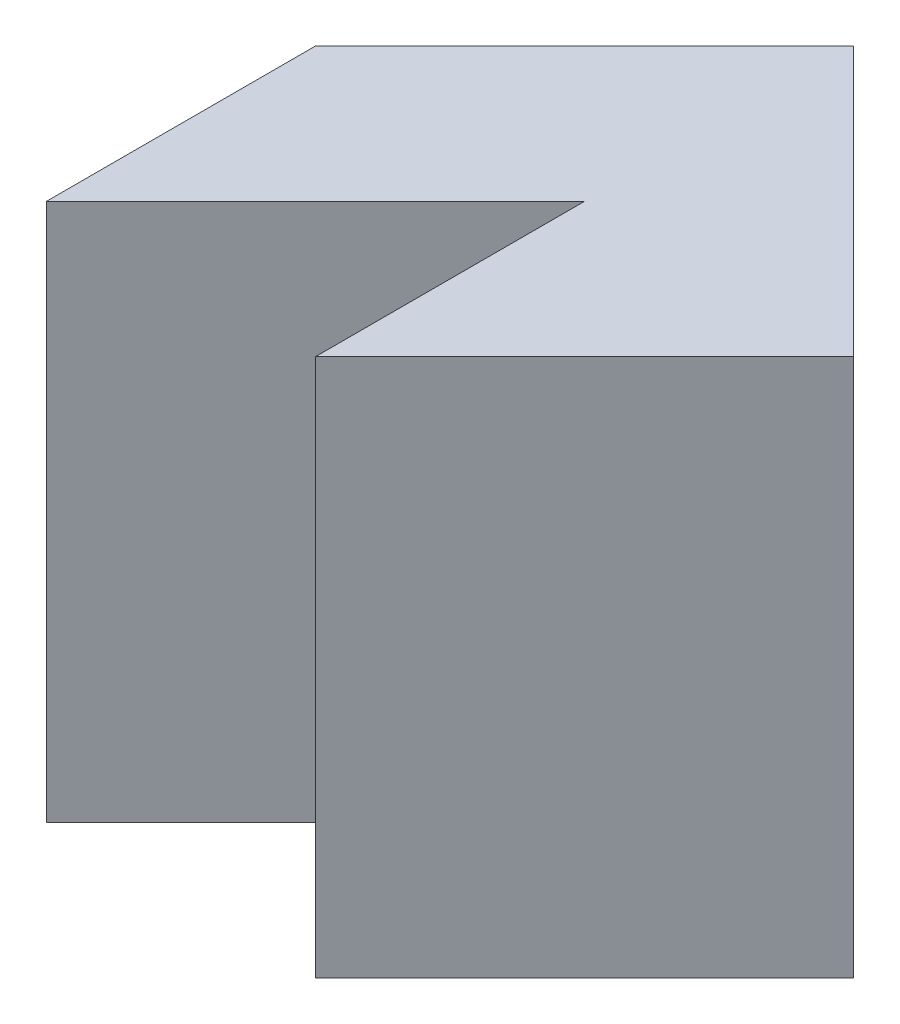
ISO-10303-21;
HEADER;
FILE_DESCRIPTION(('STEP AP214'),'2;1');
FILE_NAME('part.step','',(''),(''),'','','');
FILE_SCHEMA(('AUTOMOTIVE_DESIGN { 1 0 10303 214 1 1 1 1 }'));
ENDSEC;
DATA;
#1=APPLICATION_CONTEXT('core data for automotive mechanical design processes');
#2=APPLICATION_PROTOCOL_DEFINITION('international standard','automotive_design',2000,#1);
#3=PRODUCT_CONTEXT('',#1,'mechanical');
#4=PRODUCT('Part','Part','',(#3));
#5=PRODUCT_RELATED_PRODUCT_CATEGORY('part','',(#4));
#6=PRODUCT_DEFINITION_FORMATION('','',#4);
#7=PRODUCT_DEFINITION_CONTEXT('part definition',#1,'design');
#8=PRODUCT_DEFINITION('design','',#6,#7);
#9=PRODUCT_DEFINITION_SHAPE('','',#8);
#10=(LENGTH_UNIT() NAMED_UNIT(*) SI_UNIT(.MILLI.,.METRE.));
#11=(NAMED_UNIT(*) PLANE_ANGLE_UNIT() SI_UNIT($,.RADIAN.));
#12=(NAMED_UNIT(*) SI_UNIT($,.STERADIAN.) SOLID_ANGLE_UNIT());
#13=UNCERTAINTY_MEASURE_WITH_UNIT(LENGTH_MEASURE(1.E-05),#10,'distance_accuracy_value','');
#14=(GEOMETRIC_REPRESENTATION_CONTEXT(3) GLOBAL_UNCERTAINTY_ASSIGNED_CONTEXT((#13)) GLOBAL_UNIT_ASSIGNED_CONTEXT((#10,
#11,#12)) REPRESENTATION_CONTEXT('',''));
#15=CARTESIAN_POINT('',(0.,0.,0.));
#16=DIRECTION('',(0.,0.,1.));
#17=DIRECTION('',(1.,0.,0.));
#18=AXIS2_PLACEMENT_3D('',#15,#16,#17);
#19=CARTESIAN_POINT('',(2.,4.,-2.));
#20=DIRECTION('',(-0.707106781186547,0.,-0.707106781186548));
#21=DIRECTION('',(-0.707106781186548,0.,0.707106781186547));
#22=AXIS2_PLACEMENT_3D('',#19,#20,#21);
#23=PLANE('',#22);
#24=DIRECTION('',(0.707106781186548,0.,-0.707106781186547));
#25=VECTOR('',#24,1.);
#26=CARTESIAN_POINT('',(2.,0.,-2.));
#27=LINE('',#26,#25);
#28=CARTESIAN_POINT('',(0.,0.,0.));
#29=VERTEX_POINT('',#28);
#30=CARTESIAN_POINT('',(2.,0.,-2.));
#31=VERTEX_POINT('',#30);
#32=EDGE_CURVE('E117',#29,#31,#27,.T.);
#33=ORIENTED_EDGE('',*,*,#32,.T.);
#34=DIRECTION('',(0.,-1.,0.));
#35=VECTOR('',#34,1.);
#36=CARTESIAN_POINT('',(2.,4.,-2.));
#37=LINE('',#36,#35);
#38=CARTESIAN_POINT('',(2.,4.,-2.));
#39=VERTEX_POINT('',#38);
#40=EDGE_CURVE('E11',#39,#31,#37,.T.);
#41=ORIENTED_EDGE('',*,*,#40,.F.);
#42=DIRECTION('',(0.707106781186548,0.,-0.707106781186547));
#43=VECTOR('',#42,1.);
#44=CARTESIAN_POINT('',(2.,4.,-2.));
#45=LINE('',#44,#43);
#46=CARTESIAN_POINT('',(0.,4.,0.));
#47=VERTEX_POINT('',#46);
#48=EDGE_CURVE('E127',#47,#39,#45,.T.);
#49=ORIENTED_EDGE('',*,*,#48,.F.);
#50=DIRECTION('',(0.,-1.,0.));
#51=VECTOR('',#50,1.);
#52=CARTESIAN_POINT('',(0.,4.,0.));
#53=LINE('',#52,#51);
#54=EDGE_CURVE('E113',#47,#29,#53,.T.);
#55=ORIENTED_EDGE('',*,*,#54,.T.);
#56=EDGE_LOOP('',(#33,#41,#49,#55));
#57=FACE_BOUND('',#56,.T.);
#58=ADVANCED_FACE('F33',(#57),#23,.F.);
#59=CARTESIAN_POINT('',(0.,4.,-4.));
#60=DIRECTION('',(-0.707106781186547,0.,0.707106781186548));
#61=DIRECTION('',(0.707106781186548,0.,0.707106781186547));
#62=AXIS2_PLACEMENT_3D('',#59,#60,#61);
#63=PLANE('',#62);
#64=DIRECTION('',(-0.707106781186548,0.,-0.707106781186547));
#65=VECTOR('',#64,1.);
#66=CARTESIAN_POINT('',(0.,0.,-4.));
#67=LINE('',#66,#65);
#68=CARTESIAN_POINT('',(0.,0.,-4.));
#69=VERTEX_POINT('',#68);
#70=EDGE_CURVE('E120',#31,#69,#67,.T.);
#71=ORIENTED_EDGE('',*,*,#70,.T.);
#72=DIRECTION('',(0.,-1.,0.));
#73=VECTOR('',#72,1.);
#74=CARTESIAN_POINT('',(0.,4.,-4.));
#75=LINE('',#74,#73);
#76=CARTESIAN_POINT('',(0.,4.,-4.));
#77=VERTEX_POINT('',#76);
#78=EDGE_CURVE('E41',#77,#69,#75,.T.);
#79=ORIENTED_EDGE('',*,*,#78,.F.);
#80=DIRECTION('',(-0.707106781186548,0.,-0.707106781186547));
#81=VECTOR('',#80,1.);
#82=CARTESIAN_POINT('',(0.,4.,-4.));
#83=LINE('',#82,#81);
#84=EDGE_CURVE('E86',#39,#77,#83,.T.);
#85=ORIENTED_EDGE('',*,*,#84,.F.);
#86=ORIENTED_EDGE('',*,*,#40,.T.);
#87=EDGE_LOOP('',(#71,#79,#85,#86));
#88=FACE_BOUND('',#87,.T.);
#89=ADVANCED_FACE('F151',(#88),#63,.F.);
#90=CARTESIAN_POINT('',(-2.,4.,-2.));
#91=DIRECTION('',(0.707106781186548,0.,0.707106781186547));
#92=DIRECTION('',(0.707106781186547,0.,-0.707106781186548));
#93=AXIS2_PLACEMENT_3D('',#90,#91,#92);
#94=PLANE('',#93);
#95=DIRECTION('',(-0.707106781186548,0.,0.707106781186548));
#96=VECTOR('',#95,1.);
#97=CARTESIAN_POINT('',(-2.,0.,-2.));
#98=LINE('',#97,#96);
#99=CARTESIAN_POINT('',(-2.,0.,-2.));
#100=VERTEX_POINT('',#99);
#101=EDGE_CURVE('E122',#69,#100,#98,.T.);
#102=ORIENTED_EDGE('',*,*,#101,.T.);
#103=DIRECTION('',(0.,-1.,0.));
#104=VECTOR('',#103,1.);
#105=CARTESIAN_POINT('',(-2.,4.,-2.));
#106=LINE('',#105,#104);
#107=CARTESIAN_POINT('',(-2.,4.,-2.));
#108=VERTEX_POINT('',#107);
#109=EDGE_CURVE('E108',#108,#100,#106,.T.);
#110=ORIENTED_EDGE('',*,*,#109,.F.);
#111=DIRECTION('',(-0.707106781186548,0.,0.707106781186548));
#112=VECTOR('',#111,1.);
#113=CARTESIAN_POINT('',(-2.,4.,-2.));
#114=LINE('',#113,#112);
#115=EDGE_CURVE('E99',#77,#108,#114,.T.);
#116=ORIENTED_EDGE('',*,*,#115,.F.);
#117=ORIENTED_EDGE('',*,*,#78,.T.);
#118=EDGE_LOOP('',(#102,#110,#116,#117));
#119=FACE_BOUND('',#118,.T.);
#120=ADVANCED_FACE('F133',(#119),#94,.F.);
#121=CARTESIAN_POINT('',(-2.,4.,0.));
#122=DIRECTION('',(1.,0.,0.));
#123=DIRECTION('',(0.,0.,-1.));
#124=AXIS2_PLACEMENT_3D('',#121,#122,#123);
#125=PLANE('',#124);
#126=DIRECTION('',(0.,0.,1.));
#127=VECTOR('',#126,1.);
#128=CARTESIAN_POINT('',(-2.,0.,0.));
#129=LINE('',#128,#127);
#130=CARTESIAN_POINT('',(-2.,0.,0.));
#131=VERTEX_POINT('',#130);
#132=EDGE_CURVE('E107',#100,#131,#129,.T.);
#133=ORIENTED_EDGE('',*,*,#132,.T.);
#134=DIRECTION('',(0.,-1.,0.));
#135=VECTOR('',#134,1.);
#136=CARTESIAN_POINT('',(-2.,4.,0.));
#137=LINE('',#136,#135);
#138=CARTESIAN_POINT('',(-2.,4.,0.));
#139=VERTEX_POINT('',#138);
#140=EDGE_CURVE('E104',#139,#131,#137,.T.);
#141=ORIENTED_EDGE('',*,*,#140,.F.);
#142=DIRECTION('',(0.,0.,1.));
#143=VECTOR('',#142,1.);
#144=CARTESIAN_POINT('',(-2.,4.,0.));
#145=LINE('',#144,#143);
#146=EDGE_CURVE('E93',#108,#139,#145,.T.);
#147=ORIENTED_EDGE('',*,*,#146,.F.);
#148=ORIENTED_EDGE('',*,*,#109,.T.);
#149=EDGE_LOOP('',(#133,#141,#147,#148));
#150=FACE_BOUND('',#149,.T.);
#151=ADVANCED_FACE('F105',(#150),#125,.F.);
#152=CARTESIAN_POINT('',(0.,4.,-2.));
#153=DIRECTION('',(-0.707106781186547,0.,-0.707106781186547));
#154=DIRECTION('',(-0.707106781186548,0.,0.707106781186548));
#155=AXIS2_PLACEMENT_3D('',#152,#153,#154);
#156=PLANE('',#155);
#157=DIRECTION('',(0.707106781186548,0.,-0.707106781186548));
#158=VECTOR('',#157,1.);
#159=CARTESIAN_POINT('',(0.,0.,-2.));
#160=LINE('',#159,#158);
#161=CARTESIAN_POINT('',(0.,0.,-2.));
#162=VERTEX_POINT('',#161);
#163=EDGE_CURVE('E72',#131,#162,#160,.T.);
#164=ORIENTED_EDGE('',*,*,#163,.T.);
#165=DIRECTION('',(0.,-1.,0.));
#166=VECTOR('',#165,1.);
#167=CARTESIAN_POINT('',(0.,4.,-2.));
#168=LINE('',#167,#166);
#169=CARTESIAN_POINT('',(0.,4.,-2.));
#170=VERTEX_POINT('',#169);
#171=EDGE_CURVE('E109',#170,#162,#168,.T.);
#172=ORIENTED_EDGE('',*,*,#171,.F.);
#173=DIRECTION('',(0.707106781186548,0.,-0.707106781186548));
#174=VECTOR('',#173,1.);
#175=CARTESIAN_POINT('',(0.,4.,-2.));
#176=LINE('',#175,#174);
#177=EDGE_CURVE('E97',#139,#170,#176,.T.);
#178=ORIENTED_EDGE('',*,*,#177,.F.);
#179=ORIENTED_EDGE('',*,*,#140,.T.);
#180=EDGE_LOOP('',(#164,#172,#178,#179));
#181=FACE_BOUND('',#180,.T.);
#182=ADVANCED_FACE('F111',(#181),#156,.F.);
#183=CARTESIAN_POINT('',(0.,4.,0.));
#184=DIRECTION('',(1.,0.,0.));
#185=DIRECTION('',(0.,0.,-1.));
#186=AXIS2_PLACEMENT_3D('',#183,#184,#185);
#187=PLANE('',#186);
#188=DIRECTION('',(0.,0.,1.));
#189=VECTOR('',#188,1.);
#190=CARTESIAN_POINT('',(0.,0.,0.));
#191=LINE('',#190,#189);
#192=EDGE_CURVE('E78',#162,#29,#191,.T.);
#193=ORIENTED_EDGE('',*,*,#192,.T.);
#194=ORIENTED_EDGE('',*,*,#54,.F.);
#195=DIRECTION('',(0.,0.,1.));
#196=VECTOR('',#195,1.);
#197=CARTESIAN_POINT('',(0.,4.,0.));
#198=LINE('',#197,#196);
#199=EDGE_CURVE('E49',#170,#47,#198,.T.);
#200=ORIENTED_EDGE('',*,*,#199,.F.);
#201=ORIENTED_EDGE('',*,*,#171,.T.);
#202=EDGE_LOOP('',(#193,#194,#200,#201));
#203=FACE_BOUND('',#202,.T.);
#204=ADVANCED_FACE('F140',(#203),#187,.F.);
#205=CARTESIAN_POINT('',(0.,4.,0.));
#206=DIRECTION('',(0.,1.,0.));
#207=DIRECTION('',(0.,0.,1.));
#208=AXIS2_PLACEMENT_3D('',#205,#206,#207);
#209=PLANE('',#208);
#210=ORIENTED_EDGE('',*,*,#48,.T.);
#211=ORIENTED_EDGE('',*,*,#84,.T.);
#212=ORIENTED_EDGE('',*,*,#115,.T.);
#213=ORIENTED_EDGE('',*,*,#146,.T.);
#214=ORIENTED_EDGE('',*,*,#177,.T.);
#215=ORIENTED_EDGE('',*,*,#199,.T.);
#216=EDGE_LOOP('',(#210,#211,#212,#213,#214,#215));
#217=FACE_BOUND('',#216,.T.);
#218=ADVANCED_FACE('F95',(#217),#209,.T.);
#219=CARTESIAN_POINT('',(0.,0.,0.));
#220=DIRECTION('',(0.,1.,0.));
#221=DIRECTION('',(0.,0.,1.));
#222=AXIS2_PLACEMENT_3D('',#219,#220,#221);
#223=PLANE('',#222);
#224=ORIENTED_EDGE('',*,*,#32,.F.);
#225=ORIENTED_EDGE('',*,*,#192,.F.);
#226=ORIENTED_EDGE('',*,*,#163,.F.);
#227=ORIENTED_EDGE('',*,*,#132,.F.);
#228=ORIENTED_EDGE('',*,*,#101,.F.);
#229=ORIENTED_EDGE('',*,*,#70,.F.);
#230=EDGE_LOOP('',(#224,#225,#226,#227,#228,#229));
#231=FACE_BOUND('',#230,.T.);
#232=ADVANCED_FACE('F136',(#231),#223,.F.);
#233=CLOSED_SHELL('',(#58,#89,#120,#151,#182,#204,#218,#232));
#234=MANIFOLD_SOLID_BREP('B2',#233);
#235=ADVANCED_BREP_SHAPE_REPRESENTATION('',(#18,#234),#14);
#236=SHAPE_DEFINITION_REPRESENTATION(#9,#235);
ENDSEC;
END-ISO-10303-21;
